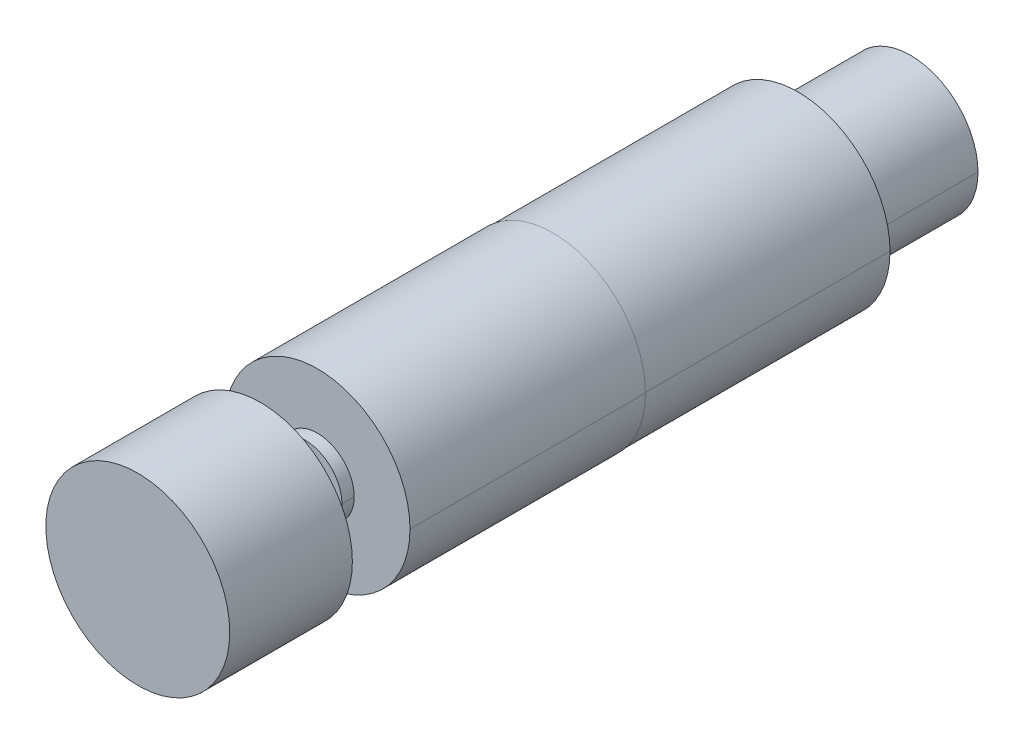
ISO-10303-21;
HEADER;
FILE_DESCRIPTION(('STEP AP214'),'2;1');
FILE_NAME('part.step','',(''),(''),'','','');
FILE_SCHEMA(('AUTOMOTIVE_DESIGN { 1 0 10303 214 1 1 1 1 }'));
ENDSEC;
DATA;
#1=APPLICATION_CONTEXT('core data for automotive mechanical design processes');
#2=APPLICATION_PROTOCOL_DEFINITION('international standard','automotive_design',2000,#1);
#3=PRODUCT_CONTEXT('',#1,'mechanical');
#4=PRODUCT('Part','Part','',(#3));
#5=PRODUCT_RELATED_PRODUCT_CATEGORY('part','',(#4));
#6=PRODUCT_DEFINITION_FORMATION('','',#4);
#7=PRODUCT_DEFINITION_CONTEXT('part definition',#1,'design');
#8=PRODUCT_DEFINITION('design','',#6,#7);
#9=PRODUCT_DEFINITION_SHAPE('','',#8);
#10=(LENGTH_UNIT() NAMED_UNIT(*) SI_UNIT(.MILLI.,.METRE.));
#11=(NAMED_UNIT(*) PLANE_ANGLE_UNIT() SI_UNIT($,.RADIAN.));
#12=(NAMED_UNIT(*) SI_UNIT($,.STERADIAN.) SOLID_ANGLE_UNIT());
#13=UNCERTAINTY_MEASURE_WITH_UNIT(LENGTH_MEASURE(1.E-05),#10,'distance_accuracy_value','');
#14=(GEOMETRIC_REPRESENTATION_CONTEXT(3) GLOBAL_UNCERTAINTY_ASSIGNED_CONTEXT((#13)) GLOBAL_UNIT_ASSIGNED_CONTEXT((#10,
#11,#12)) REPRESENTATION_CONTEXT('',''));
#15=CARTESIAN_POINT('',(0.,0.,0.));
#16=DIRECTION('',(0.,0.,1.));
#17=DIRECTION('',(1.,0.,0.));
#18=AXIS2_PLACEMENT_3D('',#15,#16,#17);
#19=CARTESIAN_POINT('',(0.,0.,47.7));
#20=DIRECTION('',(0.,0.,1.));
#21=DIRECTION('',(1.,0.,0.));
#22=AXIS2_PLACEMENT_3D('',#19,#20,#21);
#23=CYLINDRICAL_SURFACE('',#22,15.);
#24=CARTESIAN_POINT('',(0.,0.,47.7));
#25=DIRECTION('',(0.,0.,1.));
#26=DIRECTION('',(1.,0.,0.));
#27=AXIS2_PLACEMENT_3D('',#24,#25,#26);
#28=CIRCLE('',#27,15.);
#29=CARTESIAN_POINT('',(15.,0.,47.7));
#30=VERTEX_POINT('',#29);
#31=EDGE_CURVE('P0_E76',#30,#30,#28,.T.);
#32=ORIENTED_EDGE('',*,*,#31,.T.);
#33=EDGE_LOOP('',(#32));
#34=FACE_BOUND('',#33,.T.);
#35=CARTESIAN_POINT('',(0.,0.,67.7));
#36=DIRECTION('',(0.,0.,1.));
#37=DIRECTION('',(1.,0.,0.));
#38=AXIS2_PLACEMENT_3D('',#35,#36,#37);
#39=CIRCLE('',#38,15.);
#40=CARTESIAN_POINT('',(15.,0.,67.7));
#41=VERTEX_POINT('',#40);
#42=EDGE_CURVE('P0_E113',#41,#41,#39,.T.);
#43=ORIENTED_EDGE('',*,*,#42,.F.);
#44=EDGE_LOOP('',(#43));
#45=FACE_BOUND('',#44,.T.);
#46=ADVANCED_FACE('P0_F40',(#34,#45),#23,.T.);
#47=CARTESIAN_POINT('',(0.,0.,47.7));
#48=DIRECTION('',(0.,0.,1.));
#49=DIRECTION('',(1.,0.,0.));
#50=AXIS2_PLACEMENT_3D('',#47,#48,#49);
#51=PLANE('',#50);
#52=CARTESIAN_POINT('',(0.,0.,47.7));
#53=DIRECTION('',(0.,0.,1.));
#54=DIRECTION('',(1.,0.,0.));
#55=AXIS2_PLACEMENT_3D('',#52,#53,#54);
#56=CIRCLE('',#55,3.);
#57=CARTESIAN_POINT('',(3.,0.,47.7));
#58=VERTEX_POINT('',#57);
#59=CARTESIAN_POINT('',(-3.,0.,47.7));
#60=VERTEX_POINT('',#59);
#61=EDGE_CURVE('P0_E54',#58,#60,#56,.F.);
#62=ORIENTED_EDGE('',*,*,#61,.F.);
#63=CARTESIAN_POINT('',(0.,0.,47.7));
#64=DIRECTION('',(0.,0.,1.));
#65=DIRECTION('',(1.,0.,0.));
#66=AXIS2_PLACEMENT_3D('',#63,#64,#65);
#67=CIRCLE('',#66,3.);
#68=EDGE_CURVE('P0_E11',#60,#58,#67,.F.);
#69=ORIENTED_EDGE('',*,*,#68,.F.);
#70=EDGE_LOOP('',(#62,#69));
#71=FACE_BOUND('',#70,.T.);
#72=ORIENTED_EDGE('',*,*,#31,.F.);
#73=EDGE_LOOP('',(#72));
#74=FACE_BOUND('',#73,.T.);
#75=ADVANCED_FACE('P0_F70',(#71,#74),#51,.F.);
#76=CARTESIAN_POINT('',(0.,0.,67.7));
#77=DIRECTION('',(0.,0.,1.));
#78=DIRECTION('',(1.,0.,0.));
#79=AXIS2_PLACEMENT_3D('',#76,#77,#78);
#80=PLANE('',#79);
#81=ORIENTED_EDGE('',*,*,#42,.T.);
#82=EDGE_LOOP('',(#81));
#83=FACE_BOUND('',#82,.T.);
#84=ADVANCED_FACE('P0_F99',(#83),#80,.T.);
#85=CARTESIAN_POINT('',(0.,0.,57.7));
#86=DIRECTION('',(0.,0.,-1.));
#87=DIRECTION('',(-1.,0.,0.));
#88=AXIS2_PLACEMENT_3D('',#85,#86,#87);
#89=CYLINDRICAL_SURFACE('',#88,3.);
#90=DIRECTION('',(0.,0.,-1.));
#91=VECTOR('',#90,1.);
#92=CARTESIAN_POINT('',(3.,0.,57.7));
#93=LINE('',#92,#91);
#94=CARTESIAN_POINT('',(3.,0.,40.4));
#95=VERTEX_POINT('',#94);
#96=EDGE_CURVE('P0_E75',#58,#95,#93,.T.);
#97=ORIENTED_EDGE('',*,*,#96,.F.);
#98=ORIENTED_EDGE('',*,*,#61,.T.);
#99=DIRECTION('',(0.,0.,-1.));
#100=VECTOR('',#99,1.);
#101=CARTESIAN_POINT('',(-3.,0.,57.7));
#102=LINE('',#101,#100);
#103=CARTESIAN_POINT('',(-3.,0.,40.4));
#104=VERTEX_POINT('',#103);
#105=EDGE_CURVE('P0_E65',#60,#104,#102,.T.);
#106=ORIENTED_EDGE('',*,*,#105,.T.);
#107=CARTESIAN_POINT('',(0.,0.,40.4));
#108=DIRECTION('',(0.,0.,1.));
#109=DIRECTION('',(1.,0.,0.));
#110=AXIS2_PLACEMENT_3D('',#107,#108,#109);
#111=CIRCLE('',#110,3.);
#112=EDGE_CURVE('P0_E48',#104,#95,#111,.T.);
#113=ORIENTED_EDGE('',*,*,#112,.T.);
#114=EDGE_LOOP('',(#97,#98,#106,#113));
#115=FACE_BOUND('',#114,.T.);
#116=ADVANCED_FACE('P0_F74',(#115),#89,.T.);
#117=CARTESIAN_POINT('',(0.,0.,57.7));
#118=DIRECTION('',(0.,0.,-1.));
#119=DIRECTION('',(-1.,0.,0.));
#120=AXIS2_PLACEMENT_3D('',#117,#118,#119);
#121=CYLINDRICAL_SURFACE('',#120,3.);
#122=ORIENTED_EDGE('',*,*,#105,.F.);
#123=ORIENTED_EDGE('',*,*,#68,.T.);
#124=ORIENTED_EDGE('',*,*,#96,.T.);
#125=CARTESIAN_POINT('',(0.,0.,40.4));
#126=DIRECTION('',(0.,0.,1.));
#127=DIRECTION('',(1.,0.,0.));
#128=AXIS2_PLACEMENT_3D('',#125,#126,#127);
#129=CIRCLE('',#128,3.);
#130=EDGE_CURVE('P0_E81',#95,#104,#129,.T.);
#131=ORIENTED_EDGE('',*,*,#130,.T.);
#132=EDGE_LOOP('',(#122,#123,#124,#131));
#133=FACE_BOUND('',#132,.T.);
#134=ADVANCED_FACE('P0_F79',(#133),#121,.T.);
#135=CARTESIAN_POINT('',(0.,0.,40.4));
#136=DIRECTION('',(0.,0.,1.));
#137=DIRECTION('',(1.,0.,0.));
#138=AXIS2_PLACEMENT_3D('',#135,#136,#137);
#139=PLANE('',#138);
#140=ORIENTED_EDGE('',*,*,#112,.F.);
#141=ORIENTED_EDGE('',*,*,#130,.F.);
#142=EDGE_LOOP('',(#140,#141));
#143=FACE_BOUND('',#142,.T.);
#144=ADVANCED_FACE('P0_F42',(#143),#139,.F.);
#145=CLOSED_SHELL('',(#46,#75,#84,#116,#134,#144));
#146=MANIFOLD_SOLID_BREP('P0_B2',#145);
#147=CARTESIAN_POINT('',(0.,0.,40.4));
#148=DIRECTION('',(0.,0.,1.));
#149=DIRECTION('',(1.,0.,0.));
#150=AXIS2_PLACEMENT_3D('',#147,#148,#149);
#151=PLANE('',#150);
#152=CARTESIAN_POINT('',(0.,0.,40.4));
#153=DIRECTION('',(0.,0.,1.));
#154=DIRECTION('',(1.,0.,0.));
#155=AXIS2_PLACEMENT_3D('',#152,#153,#154);
#156=CIRCLE('',#155,6.);
#157=CARTESIAN_POINT('',(-6.,0.,40.4));
#158=VERTEX_POINT('',#157);
#159=CARTESIAN_POINT('',(6.,0.,40.4));
#160=VERTEX_POINT('',#159);
#161=EDGE_CURVE('P1_E11',#158,#160,#156,.T.);
#162=ORIENTED_EDGE('',*,*,#161,.T.);
#163=CARTESIAN_POINT('',(0.,0.,40.4));
#164=DIRECTION('',(0.,0.,1.));
#165=DIRECTION('',(1.,0.,0.));
#166=AXIS2_PLACEMENT_3D('',#163,#164,#165);
#167=CIRCLE('',#166,6.);
#168=EDGE_CURVE('P1_E105',#160,#158,#167,.T.);
#169=ORIENTED_EDGE('',*,*,#168,.T.);
#170=EDGE_LOOP('',(#162,#169));
#171=FACE_BOUND('',#170,.T.);
#172=ADVANCED_FACE('P1_F16',(#171),#151,.T.);
#173=CARTESIAN_POINT('',(0.,0.,40.4));
#174=DIRECTION('',(0.,0.,-1.));
#175=DIRECTION('',(-1.,0.,0.));
#176=AXIS2_PLACEMENT_3D('',#173,#174,#175);
#177=CYLINDRICAL_SURFACE('',#176,6.);
#178=DIRECTION('',(0.,0.,-1.));
#179=VECTOR('',#178,1.);
#180=CARTESIAN_POINT('',(6.,0.,40.4));
#181=LINE('',#180,#179);
#182=CARTESIAN_POINT('',(6.,0.,38.4));
#183=VERTEX_POINT('',#182);
#184=EDGE_CURVE('P1_E103',#160,#183,#181,.T.);
#185=ORIENTED_EDGE('',*,*,#184,.F.);
#186=ORIENTED_EDGE('',*,*,#161,.F.);
#187=DIRECTION('',(0.,0.,-1.));
#188=VECTOR('',#187,1.);
#189=CARTESIAN_POINT('',(-6.,0.,40.4));
#190=LINE('',#189,#188);
#191=CARTESIAN_POINT('',(-6.,0.,38.4));
#192=VERTEX_POINT('',#191);
#193=EDGE_CURVE('P1_E92',#158,#192,#190,.T.);
#194=ORIENTED_EDGE('',*,*,#193,.T.);
#195=CARTESIAN_POINT('',(0.,0.,38.4));
#196=DIRECTION('',(0.,0.,1.));
#197=DIRECTION('',(1.,0.,0.));
#198=AXIS2_PLACEMENT_3D('',#195,#196,#197);
#199=CIRCLE('',#198,6.);
#200=EDGE_CURVE('P1_E26',#192,#183,#199,.T.);
#201=ORIENTED_EDGE('',*,*,#200,.T.);
#202=EDGE_LOOP('',(#185,#186,#194,#201));
#203=FACE_BOUND('',#202,.T.);
#204=ADVANCED_FACE('P1_F121',(#203),#177,.T.);
#205=CARTESIAN_POINT('',(0.,0.,0.));
#206=DIRECTION('',(0.,0.,1.));
#207=DIRECTION('',(1.,0.,0.));
#208=AXIS2_PLACEMENT_3D('',#205,#206,#207);
#209=PLANE('',#208);
#210=CARTESIAN_POINT('',(0.,0.,0.));
#211=DIRECTION('',(0.,0.,1.));
#212=DIRECTION('',(1.,0.,0.));
#213=AXIS2_PLACEMENT_3D('',#210,#211,#212);
#214=CIRCLE('',#213,15.1);
#215=CARTESIAN_POINT('',(-15.1,0.,0.));
#216=VERTEX_POINT('',#215);
#217=CARTESIAN_POINT('',(15.1,0.,0.));
#218=VERTEX_POINT('',#217);
#219=EDGE_CURVE('P1_E39',#216,#218,#214,.T.);
#220=ORIENTED_EDGE('',*,*,#219,.F.);
#221=CARTESIAN_POINT('',(0.,0.,0.));
#222=DIRECTION('',(0.,0.,1.));
#223=DIRECTION('',(1.,0.,0.));
#224=AXIS2_PLACEMENT_3D('',#221,#222,#223);
#225=CIRCLE('',#224,15.1);
#226=EDGE_CURVE('P1_E89',#218,#216,#225,.T.);
#227=ORIENTED_EDGE('',*,*,#226,.F.);
#228=EDGE_LOOP('',(#220,#227));
#229=FACE_BOUND('',#228,.T.);
#230=ADVANCED_FACE('P1_F119',(#229),#209,.F.);
#231=CARTESIAN_POINT('',(0.,0.,38.4));
#232=DIRECTION('',(0.,0.,1.));
#233=DIRECTION('',(1.,0.,0.));
#234=AXIS2_PLACEMENT_3D('',#231,#232,#233);
#235=PLANE('',#234);
#236=ORIENTED_EDGE('',*,*,#200,.F.);
#237=CARTESIAN_POINT('',(0.,0.,38.4));
#238=DIRECTION('',(0.,0.,1.));
#239=DIRECTION('',(1.,0.,0.));
#240=AXIS2_PLACEMENT_3D('',#237,#238,#239);
#241=CIRCLE('',#240,6.);
#242=EDGE_CURVE('P1_E99',#183,#192,#241,.T.);
#243=ORIENTED_EDGE('',*,*,#242,.F.);
#244=EDGE_LOOP('',(#236,#243));
#245=FACE_BOUND('',#244,.T.);
#246=CARTESIAN_POINT('',(0.,0.,38.4));
#247=DIRECTION('',(0.,0.,1.));
#248=DIRECTION('',(1.,0.,0.));
#249=AXIS2_PLACEMENT_3D('',#246,#247,#248);
#250=CIRCLE('',#249,15.1);
#251=CARTESIAN_POINT('',(-15.1,0.,38.4));
#252=VERTEX_POINT('',#251);
#253=CARTESIAN_POINT('',(15.1,0.,38.4));
#254=VERTEX_POINT('',#253);
#255=EDGE_CURVE('P1_E77',#252,#254,#250,.T.);
#256=ORIENTED_EDGE('',*,*,#255,.T.);
#257=CARTESIAN_POINT('',(0.,0.,38.4));
#258=DIRECTION('',(0.,0.,1.));
#259=DIRECTION('',(1.,0.,0.));
#260=AXIS2_PLACEMENT_3D('',#257,#258,#259);
#261=CIRCLE('',#260,15.1);
#262=EDGE_CURVE('P1_E79',#254,#252,#261,.T.);
#263=ORIENTED_EDGE('',*,*,#262,.T.);
#264=EDGE_LOOP('',(#256,#263));
#265=FACE_BOUND('',#264,.T.);
#266=ADVANCED_FACE('P1_F18',(#245,#265),#235,.T.);
#267=CARTESIAN_POINT('',(0.,0.,38.4));
#268=DIRECTION('',(0.,0.,-1.));
#269=DIRECTION('',(-1.,0.,0.));
#270=AXIS2_PLACEMENT_3D('',#267,#268,#269);
#271=CYLINDRICAL_SURFACE('',#270,15.1);
#272=DIRECTION('',(0.,0.,-1.));
#273=VECTOR('',#272,1.);
#274=CARTESIAN_POINT('',(15.1,0.,38.4));
#275=LINE('',#274,#273);
#276=EDGE_CURVE('P1_E20',#254,#218,#275,.T.);
#277=ORIENTED_EDGE('',*,*,#276,.F.);
#278=ORIENTED_EDGE('',*,*,#255,.F.);
#279=DIRECTION('',(0.,0.,-1.));
#280=VECTOR('',#279,1.);
#281=CARTESIAN_POINT('',(-15.1,0.,38.4));
#282=LINE('',#281,#280);
#283=EDGE_CURVE('P1_E82',#252,#216,#282,.T.);
#284=ORIENTED_EDGE('',*,*,#283,.T.);
#285=ORIENTED_EDGE('',*,*,#219,.T.);
#286=EDGE_LOOP('',(#277,#278,#284,#285));
#287=FACE_BOUND('',#286,.T.);
#288=ADVANCED_FACE('P1_F85',(#287),#271,.T.);
#289=CARTESIAN_POINT('',(0.,0.,38.4));
#290=DIRECTION('',(0.,0.,-1.));
#291=DIRECTION('',(-1.,0.,0.));
#292=AXIS2_PLACEMENT_3D('',#289,#290,#291);
#293=CYLINDRICAL_SURFACE('',#292,15.1);
#294=ORIENTED_EDGE('',*,*,#262,.F.);
#295=ORIENTED_EDGE('',*,*,#276,.T.);
#296=ORIENTED_EDGE('',*,*,#226,.T.);
#297=ORIENTED_EDGE('',*,*,#283,.F.);
#298=EDGE_LOOP('',(#294,#295,#296,#297));
#299=FACE_BOUND('',#298,.T.);
#300=ADVANCED_FACE('P1_F90',(#299),#293,.T.);
#301=CARTESIAN_POINT('',(0.,0.,40.4));
#302=DIRECTION('',(0.,0.,-1.));
#303=DIRECTION('',(-1.,0.,0.));
#304=AXIS2_PLACEMENT_3D('',#301,#302,#303);
#305=CYLINDRICAL_SURFACE('',#304,6.);
#306=ORIENTED_EDGE('',*,*,#168,.F.);
#307=ORIENTED_EDGE('',*,*,#184,.T.);
#308=ORIENTED_EDGE('',*,*,#242,.T.);
#309=ORIENTED_EDGE('',*,*,#193,.F.);
#310=EDGE_LOOP('',(#306,#307,#308,#309));
#311=FACE_BOUND('',#310,.T.);
#312=ADVANCED_FACE('P1_F139',(#311),#305,.T.);
#313=CLOSED_SHELL('',(#172,#204,#230,#266,#288,#300,#312));
#314=MANIFOLD_SOLID_BREP('P1_B1',#313);
#315=CARTESIAN_POINT('',(0.,0.,0.));
#316=DIRECTION('',(0.,0.,-1.));
#317=DIRECTION('',(0.,-1.,0.));
#318=AXIS2_PLACEMENT_3D('',#315,#316,#317);
#319=PLANE('',#318);
#320=CARTESIAN_POINT('',(0.,0.,0.));
#321=DIRECTION('',(0.,0.,-1.));
#322=DIRECTION('',(-1.,0.,0.));
#323=AXIS2_PLACEMENT_3D('',#320,#321,#322);
#324=CIRCLE('',#323,15.);
#325=CARTESIAN_POINT('',(15.,0.,0.));
#326=VERTEX_POINT('',#325);
#327=CARTESIAN_POINT('',(-15.,0.,0.));
#328=VERTEX_POINT('',#327);
#329=EDGE_CURVE('P2_E11',#326,#328,#324,.T.);
#330=ORIENTED_EDGE('',*,*,#329,.F.);
#331=CARTESIAN_POINT('',(0.,0.,0.));
#332=DIRECTION('',(0.,0.,-1.));
#333=DIRECTION('',(-1.,0.,0.));
#334=AXIS2_PLACEMENT_3D('',#331,#332,#333);
#335=CIRCLE('',#334,15.);
#336=EDGE_CURVE('P2_E64',#328,#326,#335,.T.);
#337=ORIENTED_EDGE('',*,*,#336,.F.);
#338=EDGE_LOOP('',(#330,#337));
#339=FACE_BOUND('',#338,.T.);
#340=ADVANCED_FACE('P2_F16',(#339),#319,.F.);
#341=CARTESIAN_POINT('',(0.,0.,-40.));
#342=DIRECTION('',(0.,0.,-1.));
#343=DIRECTION('',(0.,-1.,0.));
#344=AXIS2_PLACEMENT_3D('',#341,#342,#343);
#345=PLANE('',#344);
#346=CARTESIAN_POINT('',(0.,0.,-40.));
#347=DIRECTION('',(0.,0.,-1.));
#348=DIRECTION('',(-1.,0.,0.));
#349=AXIS2_PLACEMENT_3D('',#346,#347,#348);
#350=CIRCLE('',#349,15.);
#351=CARTESIAN_POINT('',(15.,0.,-40.));
#352=VERTEX_POINT('',#351);
#353=CARTESIAN_POINT('',(-15.,0.,-40.));
#354=VERTEX_POINT('',#353);
#355=EDGE_CURVE('P2_E27',#352,#354,#350,.T.);
#356=ORIENTED_EDGE('',*,*,#355,.T.);
#357=CARTESIAN_POINT('',(0.,0.,-40.));
#358=DIRECTION('',(0.,0.,-1.));
#359=DIRECTION('',(-1.,0.,0.));
#360=AXIS2_PLACEMENT_3D('',#357,#358,#359);
#361=CIRCLE('',#360,15.);
#362=EDGE_CURVE('P2_E20',#354,#352,#361,.T.);
#363=ORIENTED_EDGE('',*,*,#362,.T.);
#364=EDGE_LOOP('',(#356,#363));
#365=FACE_BOUND('',#364,.T.);
#366=ADVANCED_FACE('P2_F18',(#365),#345,.T.);
#367=CARTESIAN_POINT('',(0.,0.,-40.));
#368=DIRECTION('',(0.,0.,1.));
#369=DIRECTION('',(1.,0.,0.));
#370=AXIS2_PLACEMENT_3D('',#367,#368,#369);
#371=CYLINDRICAL_SURFACE('',#370,15.);
#372=DIRECTION('',(0.,0.,1.));
#373=VECTOR('',#372,1.);
#374=CARTESIAN_POINT('',(-15.,0.,-40.));
#375=LINE('',#374,#373);
#376=EDGE_CURVE('P2_E56',#354,#328,#375,.T.);
#377=ORIENTED_EDGE('',*,*,#376,.F.);
#378=ORIENTED_EDGE('',*,*,#355,.F.);
#379=DIRECTION('',(0.,0.,1.));
#380=VECTOR('',#379,1.);
#381=CARTESIAN_POINT('',(15.,0.,-40.));
#382=LINE('',#381,#380);
#383=EDGE_CURVE('P2_E53',#352,#326,#382,.T.);
#384=ORIENTED_EDGE('',*,*,#383,.T.);
#385=ORIENTED_EDGE('',*,*,#329,.T.);
#386=EDGE_LOOP('',(#377,#378,#384,#385));
#387=FACE_BOUND('',#386,.T.);
#388=ADVANCED_FACE('P2_F52',(#387),#371,.T.);
#389=CARTESIAN_POINT('',(0.,0.,-40.));
#390=DIRECTION('',(0.,0.,1.));
#391=DIRECTION('',(1.,0.,0.));
#392=AXIS2_PLACEMENT_3D('',#389,#390,#391);
#393=CYLINDRICAL_SURFACE('',#392,15.);
#394=ORIENTED_EDGE('',*,*,#362,.F.);
#395=ORIENTED_EDGE('',*,*,#376,.T.);
#396=ORIENTED_EDGE('',*,*,#336,.T.);
#397=ORIENTED_EDGE('',*,*,#383,.F.);
#398=EDGE_LOOP('',(#394,#395,#396,#397));
#399=FACE_BOUND('',#398,.T.);
#400=ADVANCED_FACE('P2_F63',(#399),#393,.T.);
#401=CLOSED_SHELL('',(#340,#366,#388,#400));
#402=MANIFOLD_SOLID_BREP('P2_B1',#401);
#403=CARTESIAN_POINT('',(0.,0.,-40.));
#404=DIRECTION('',(0.,0.,-1.));
#405=DIRECTION('',(0.,-1.,0.));
#406=AXIS2_PLACEMENT_3D('',#403,#404,#405);
#407=PLANE('',#406);
#408=CARTESIAN_POINT('',(0.,0.,-40.));
#409=DIRECTION('',(0.,0.,-1.));
#410=DIRECTION('',(-1.,0.,0.));
#411=AXIS2_PLACEMENT_3D('',#408,#409,#410);
#412=CIRCLE('',#411,11.);
#413=CARTESIAN_POINT('',(11.,0.,-40.));
#414=VERTEX_POINT('',#413);
#415=CARTESIAN_POINT('',(-11.,0.,-40.));
#416=VERTEX_POINT('',#415);
#417=EDGE_CURVE('P3_E11',#414,#416,#412,.T.);
#418=ORIENTED_EDGE('',*,*,#417,.F.);
#419=CARTESIAN_POINT('',(0.,0.,-40.));
#420=DIRECTION('',(0.,0.,-1.));
#421=DIRECTION('',(-1.,0.,0.));
#422=AXIS2_PLACEMENT_3D('',#419,#420,#421);
#423=CIRCLE('',#422,11.);
#424=EDGE_CURVE('P3_E65',#416,#414,#423,.T.);
#425=ORIENTED_EDGE('',*,*,#424,.F.);
#426=EDGE_LOOP('',(#418,#425));
#427=FACE_BOUND('',#426,.T.);
#428=ADVANCED_FACE('P3_F16',(#427),#407,.F.);
#429=CARTESIAN_POINT('',(0.,0.,-58.35));
#430=DIRECTION('',(0.,0.,-1.));
#431=DIRECTION('',(0.,-1.,0.));
#432=AXIS2_PLACEMENT_3D('',#429,#430,#431);
#433=PLANE('',#432);
#434=CARTESIAN_POINT('',(0.,0.,-58.35));
#435=DIRECTION('',(0.,0.,-1.));
#436=DIRECTION('',(-1.,0.,0.));
#437=AXIS2_PLACEMENT_3D('',#434,#435,#436);
#438=CIRCLE('',#437,11.);
#439=CARTESIAN_POINT('',(11.,0.,-58.35));
#440=VERTEX_POINT('',#439);
#441=CARTESIAN_POINT('',(-11.,0.,-58.35));
#442=VERTEX_POINT('',#441);
#443=EDGE_CURVE('P3_E25',#440,#442,#438,.T.);
#444=ORIENTED_EDGE('',*,*,#443,.T.);
#445=CARTESIAN_POINT('',(0.,0.,-58.35));
#446=DIRECTION('',(0.,0.,-1.));
#447=DIRECTION('',(-1.,0.,0.));
#448=AXIS2_PLACEMENT_3D('',#445,#446,#447);
#449=CIRCLE('',#448,11.);
#450=EDGE_CURVE('P3_E19',#442,#440,#449,.T.);
#451=ORIENTED_EDGE('',*,*,#450,.T.);
#452=EDGE_LOOP('',(#444,#451));
#453=FACE_BOUND('',#452,.T.);
#454=ADVANCED_FACE('P3_F53',(#453),#433,.T.);
#455=CARTESIAN_POINT('',(0.,0.,-58.35));
#456=DIRECTION('',(0.,0.,1.));
#457=DIRECTION('',(1.,0.,0.));
#458=AXIS2_PLACEMENT_3D('',#455,#456,#457);
#459=CYLINDRICAL_SURFACE('',#458,11.);
#460=DIRECTION('',(0.,0.,1.));
#461=VECTOR('',#460,1.);
#462=CARTESIAN_POINT('',(-11.,0.,-58.35));
#463=LINE('',#462,#461);
#464=EDGE_CURVE('P3_E60',#442,#416,#463,.T.);
#465=ORIENTED_EDGE('',*,*,#464,.F.);
#466=ORIENTED_EDGE('',*,*,#443,.F.);
#467=DIRECTION('',(0.,0.,1.));
#468=VECTOR('',#467,1.);
#469=CARTESIAN_POINT('',(11.,0.,-58.35));
#470=LINE('',#469,#468);
#471=EDGE_CURVE('P3_E57',#440,#414,#470,.T.);
#472=ORIENTED_EDGE('',*,*,#471,.T.);
#473=ORIENTED_EDGE('',*,*,#417,.T.);
#474=EDGE_LOOP('',(#465,#466,#472,#473));
#475=FACE_BOUND('',#474,.T.);
#476=ADVANCED_FACE('P3_F61',(#475),#459,.T.);
#477=CARTESIAN_POINT('',(0.,0.,-58.35));
#478=DIRECTION('',(0.,0.,1.));
#479=DIRECTION('',(1.,0.,0.));
#480=AXIS2_PLACEMENT_3D('',#477,#478,#479);
#481=CYLINDRICAL_SURFACE('',#480,11.);
#482=ORIENTED_EDGE('',*,*,#450,.F.);
#483=ORIENTED_EDGE('',*,*,#464,.T.);
#484=ORIENTED_EDGE('',*,*,#424,.T.);
#485=ORIENTED_EDGE('',*,*,#471,.F.);
#486=EDGE_LOOP('',(#482,#483,#484,#485));
#487=FACE_BOUND('',#486,.T.);
#488=ADVANCED_FACE('P3_F67',(#487),#481,.T.);
#489=CLOSED_SHELL('',(#428,#454,#476,#488));
#490=MANIFOLD_SOLID_BREP('P3_B1',#489);
#491=ADVANCED_BREP_SHAPE_REPRESENTATION('',(#18,#146,#314,#402,#490),#14);
#492=SHAPE_DEFINITION_REPRESENTATION(#9,#491);
ENDSEC;
END-ISO-10303-21;
